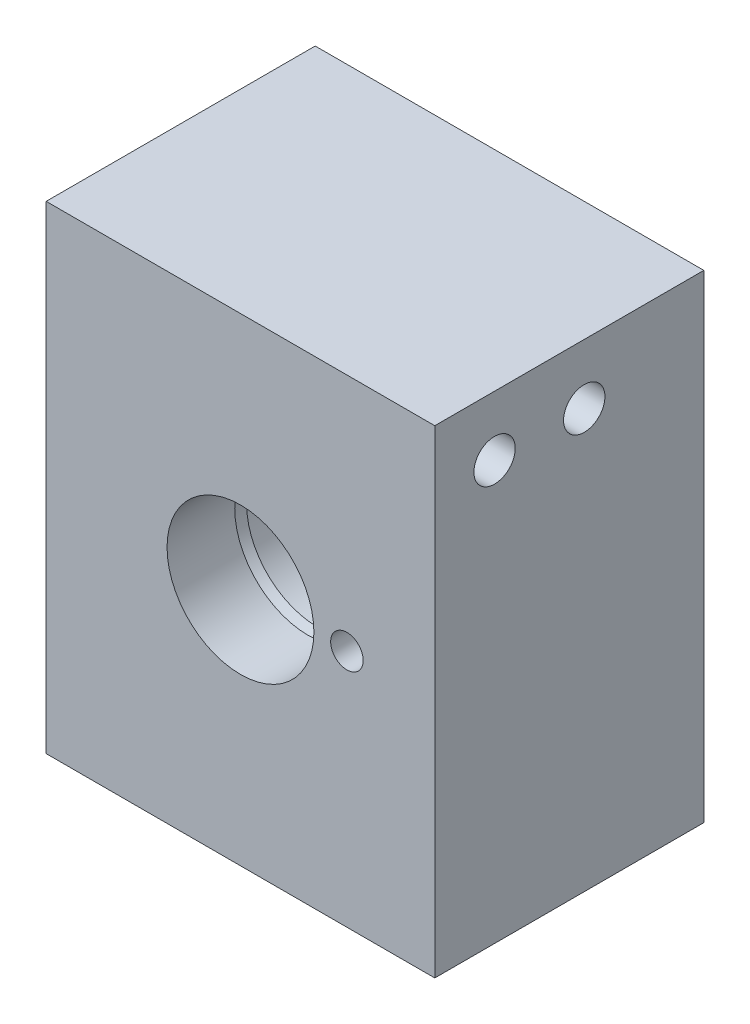
ISO-10303-21;
HEADER;
FILE_DESCRIPTION(('STEP AP214'),'2;1');
FILE_NAME('part.step','',(''),(''),'','','');
FILE_SCHEMA(('AUTOMOTIVE_DESIGN { 1 0 10303 214 1 1 1 1 }'));
ENDSEC;
DATA;
#1=APPLICATION_CONTEXT('core data for automotive mechanical design processes');
#2=APPLICATION_PROTOCOL_DEFINITION('international standard','automotive_design',2000,#1);
#3=PRODUCT_CONTEXT('',#1,'mechanical');
#4=PRODUCT('Part','Part','',(#3));
#5=PRODUCT_RELATED_PRODUCT_CATEGORY('part','',(#4));
#6=PRODUCT_DEFINITION_FORMATION('','',#4);
#7=PRODUCT_DEFINITION_CONTEXT('part definition',#1,'design');
#8=PRODUCT_DEFINITION('design','',#6,#7);
#9=PRODUCT_DEFINITION_SHAPE('','',#8);
#10=(LENGTH_UNIT() NAMED_UNIT(*) SI_UNIT(.MILLI.,.METRE.));
#11=(NAMED_UNIT(*) PLANE_ANGLE_UNIT() SI_UNIT($,.RADIAN.));
#12=(NAMED_UNIT(*) SI_UNIT($,.STERADIAN.) SOLID_ANGLE_UNIT());
#13=UNCERTAINTY_MEASURE_WITH_UNIT(LENGTH_MEASURE(1.E-05),#10,'distance_accuracy_value','');
#14=(GEOMETRIC_REPRESENTATION_CONTEXT(3) GLOBAL_UNCERTAINTY_ASSIGNED_CONTEXT((#13)) GLOBAL_UNIT_ASSIGNED_CONTEXT((#10,
#11,#12)) REPRESENTATION_CONTEXT('',''));
#15=CARTESIAN_POINT('',(0.,0.,0.));
#16=DIRECTION('',(0.,0.,1.));
#17=DIRECTION('',(1.,0.,0.));
#18=AXIS2_PLACEMENT_3D('',#15,#16,#17);
#19=CARTESIAN_POINT('',(19.0499999999998,50.8,22.225));
#20=DIRECTION('',(0.,0.,-1.));
#21=DIRECTION('',(-1.,0.,0.));
#22=AXIS2_PLACEMENT_3D('',#19,#20,#21);
#23=PLANE('',#22);
#24=CARTESIAN_POINT('',(9.71549999999977,25.4,22.225));
#25=DIRECTION('',(0.,0.,1.));
#26=DIRECTION('',(1.,0.,0.));
#27=AXIS2_PLACEMENT_3D('',#24,#25,#26);
#28=CIRCLE('',#27,1.72719999999999);
#29=CARTESIAN_POINT('',(11.4426999999998,25.4,22.225));
#30=VERTEX_POINT('',#29);
#31=EDGE_CURVE('E316',#30,#30,#28,.T.);
#32=ORIENTED_EDGE('',*,*,#31,.F.);
#33=EDGE_LOOP('',(#32));
#34=FACE_BOUND('',#33,.T.);
#35=CARTESIAN_POINT('',(-1.58750000000023,25.4,22.225));
#36=DIRECTION('',(0.,0.,-1.));
#37=DIRECTION('',(-1.,0.,0.));
#38=AXIS2_PLACEMENT_3D('',#35,#36,#37);
#39=CIRCLE('',#38,7.7978);
#40=CARTESIAN_POINT('',(-9.38530000000023,25.4,22.225));
#41=VERTEX_POINT('',#40);
#42=EDGE_CURVE('E231',#41,#41,#39,.T.);
#43=ORIENTED_EDGE('',*,*,#42,.T.);
#44=EDGE_LOOP('',(#43));
#45=FACE_BOUND('',#44,.T.);
#46=DIRECTION('',(1.,0.,0.));
#47=VECTOR('',#46,1.);
#48=CARTESIAN_POINT('',(19.0499999999998,0.,22.225));
#49=LINE('',#48,#47);
#50=CARTESIAN_POINT('',(-22.2250000000002,0.,22.225));
#51=VERTEX_POINT('',#50);
#52=CARTESIAN_POINT('',(19.0499999999998,0.,22.225));
#53=VERTEX_POINT('',#52);
#54=EDGE_CURVE('E253',#51,#53,#49,.T.);
#55=ORIENTED_EDGE('',*,*,#54,.T.);
#56=DIRECTION('',(0.,-1.,0.));
#57=VECTOR('',#56,1.);
#58=CARTESIAN_POINT('',(19.0499999999998,50.8,22.225));
#59=LINE('',#58,#57);
#60=CARTESIAN_POINT('',(19.0499999999998,50.8,22.225));
#61=VERTEX_POINT('',#60);
#62=EDGE_CURVE('E223',#61,#53,#59,.T.);
#63=ORIENTED_EDGE('',*,*,#62,.F.);
#64=DIRECTION('',(1.,0.,0.));
#65=VECTOR('',#64,1.);
#66=CARTESIAN_POINT('',(19.0499999999998,50.8,22.225));
#67=LINE('',#66,#65);
#68=CARTESIAN_POINT('',(-22.2250000000002,50.8,22.225));
#69=VERTEX_POINT('',#68);
#70=EDGE_CURVE('E246',#69,#61,#67,.T.);
#71=ORIENTED_EDGE('',*,*,#70,.F.);
#72=DIRECTION('',(0.,-1.,0.));
#73=VECTOR('',#72,1.);
#74=CARTESIAN_POINT('',(-22.2250000000002,50.8,22.225));
#75=LINE('',#74,#73);
#76=EDGE_CURVE('E241',#69,#51,#75,.T.);
#77=ORIENTED_EDGE('',*,*,#76,.T.);
#78=EDGE_LOOP('',(#55,#63,#71,#77));
#79=FACE_BOUND('',#78,.T.);
#80=ADVANCED_FACE('F45',(#34,#45,#79),#23,.F.);
#81=CARTESIAN_POINT('',(19.0499999999998,50.8,-6.35));
#82=DIRECTION('',(-1.,0.,0.));
#83=DIRECTION('',(0.,0.,1.));
#84=AXIS2_PLACEMENT_3D('',#81,#82,#83);
#85=PLANE('',#84);
#86=CARTESIAN_POINT('',(19.0499999999998,44.45,6.35000000000001));
#87=DIRECTION('',(-1.,0.,0.));
#88=DIRECTION('',(0.,0.,1.));
#89=AXIS2_PLACEMENT_3D('',#86,#87,#88);
#90=CIRCLE('',#89,2.19709999999999);
#91=CARTESIAN_POINT('',(19.0499999999998,44.45,8.54709999999999));
#92=VERTEX_POINT('',#91);
#93=EDGE_CURVE('E344',#92,#92,#90,.T.);
#94=ORIENTED_EDGE('',*,*,#93,.T.);
#95=EDGE_LOOP('',(#94));
#96=FACE_BOUND('',#95,.T.);
#97=CARTESIAN_POINT('',(19.0499999999998,44.45,15.875));
#98=DIRECTION('',(-1.,0.,0.));
#99=DIRECTION('',(0.,0.,1.));
#100=AXIS2_PLACEMENT_3D('',#97,#98,#99);
#101=CIRCLE('',#100,2.19709999999999);
#102=CARTESIAN_POINT('',(19.0499999999998,44.45,18.0721));
#103=VERTEX_POINT('',#102);
#104=EDGE_CURVE('E336',#103,#103,#101,.T.);
#105=ORIENTED_EDGE('',*,*,#104,.T.);
#106=EDGE_LOOP('',(#105));
#107=FACE_BOUND('',#106,.T.);
#108=DIRECTION('',(0.,0.,-1.));
#109=VECTOR('',#108,1.);
#110=CARTESIAN_POINT('',(19.0499999999998,0.,-6.35));
#111=LINE('',#110,#109);
#112=CARTESIAN_POINT('',(19.0499999999998,0.,-6.35));
#113=VERTEX_POINT('',#112);
#114=EDGE_CURVE('E250',#53,#113,#111,.T.);
#115=ORIENTED_EDGE('',*,*,#114,.T.);
#116=DIRECTION('',(0.,-1.,0.));
#117=VECTOR('',#116,1.);
#118=CARTESIAN_POINT('',(19.0499999999998,50.8,-6.35));
#119=LINE('',#118,#117);
#120=CARTESIAN_POINT('',(19.0499999999998,50.8,-6.35));
#121=VERTEX_POINT('',#120);
#122=EDGE_CURVE('E234',#121,#113,#119,.T.);
#123=ORIENTED_EDGE('',*,*,#122,.F.);
#124=DIRECTION('',(0.,0.,-1.));
#125=VECTOR('',#124,1.);
#126=CARTESIAN_POINT('',(19.0499999999998,50.8,-6.35));
#127=LINE('',#126,#125);
#128=EDGE_CURVE('E105',#61,#121,#127,.T.);
#129=ORIENTED_EDGE('',*,*,#128,.F.);
#130=ORIENTED_EDGE('',*,*,#62,.T.);
#131=EDGE_LOOP('',(#115,#123,#129,#130));
#132=FACE_BOUND('',#131,.T.);
#133=ADVANCED_FACE('F137',(#96,#107,#132),#85,.F.);
#134=CARTESIAN_POINT('',(-22.2250000000002,50.8,-6.35));
#135=DIRECTION('',(0.,0.,1.));
#136=DIRECTION('',(1.,0.,0.));
#137=AXIS2_PLACEMENT_3D('',#134,#135,#136);
#138=PLANE('',#137);
#139=CARTESIAN_POINT('',(-1.58750000000023,25.4,-6.35));
#140=DIRECTION('',(0.,0.,-1.));
#141=DIRECTION('',(-1.,0.,0.));
#142=AXIS2_PLACEMENT_3D('',#139,#140,#141);
#143=CIRCLE('',#142,9.525);
#144=CARTESIAN_POINT('',(-11.1125000000002,25.4,-6.35));
#145=VERTEX_POINT('',#144);
#146=EDGE_CURVE('E230',#145,#145,#143,.T.);
#147=ORIENTED_EDGE('',*,*,#146,.F.);
#148=EDGE_LOOP('',(#147));
#149=FACE_BOUND('',#148,.T.);
#150=DIRECTION('',(-1.,0.,0.));
#151=VECTOR('',#150,1.);
#152=CARTESIAN_POINT('',(-22.2250000000002,0.,-6.35));
#153=LINE('',#152,#151);
#154=CARTESIAN_POINT('',(-22.2250000000002,0.,-6.35));
#155=VERTEX_POINT('',#154);
#156=EDGE_CURVE('E247',#113,#155,#153,.T.);
#157=ORIENTED_EDGE('',*,*,#156,.T.);
#158=DIRECTION('',(0.,-1.,0.));
#159=VECTOR('',#158,1.);
#160=CARTESIAN_POINT('',(-22.2250000000002,50.8,-6.35));
#161=LINE('',#160,#159);
#162=CARTESIAN_POINT('',(-22.2250000000002,50.8,-6.35));
#163=VERTEX_POINT('',#162);
#164=EDGE_CURVE('E238',#163,#155,#161,.T.);
#165=ORIENTED_EDGE('',*,*,#164,.F.);
#166=DIRECTION('',(-1.,0.,0.));
#167=VECTOR('',#166,1.);
#168=CARTESIAN_POINT('',(-22.2250000000002,50.8,-6.35));
#169=LINE('',#168,#167);
#170=EDGE_CURVE('E260',#121,#163,#169,.T.);
#171=ORIENTED_EDGE('',*,*,#170,.F.);
#172=ORIENTED_EDGE('',*,*,#122,.T.);
#173=EDGE_LOOP('',(#157,#165,#171,#172));
#174=FACE_BOUND('',#173,.T.);
#175=ADVANCED_FACE('F142',(#149,#174),#138,.F.);
#176=CARTESIAN_POINT('',(-22.2250000000002,50.8,-6.35));
#177=DIRECTION('',(1.,0.,0.));
#178=DIRECTION('',(0.,0.,-1.));
#179=AXIS2_PLACEMENT_3D('',#176,#177,#178);
#180=PLANE('',#179);
#181=CARTESIAN_POINT('',(-22.2250000000002,44.45,6.35000000000001));
#182=DIRECTION('',(-1.,0.,0.));
#183=DIRECTION('',(0.,0.,1.));
#184=AXIS2_PLACEMENT_3D('',#181,#182,#183);
#185=CIRCLE('',#184,2.19709999999999);
#186=CARTESIAN_POINT('',(-22.2250000000002,44.45,8.5471));
#187=VERTEX_POINT('',#186);
#188=EDGE_CURVE('E348',#187,#187,#185,.T.);
#189=ORIENTED_EDGE('',*,*,#188,.F.);
#190=EDGE_LOOP('',(#189));
#191=FACE_BOUND('',#190,.T.);
#192=CARTESIAN_POINT('',(-22.2250000000002,44.45,15.875));
#193=DIRECTION('',(-1.,0.,0.));
#194=DIRECTION('',(0.,0.,1.));
#195=AXIS2_PLACEMENT_3D('',#192,#193,#194);
#196=CIRCLE('',#195,2.19709999999999);
#197=CARTESIAN_POINT('',(-22.2250000000002,44.45,18.0721));
#198=VERTEX_POINT('',#197);
#199=EDGE_CURVE('E340',#198,#198,#196,.T.);
#200=ORIENTED_EDGE('',*,*,#199,.F.);
#201=EDGE_LOOP('',(#200));
#202=FACE_BOUND('',#201,.T.);
#203=DIRECTION('',(0.,0.,1.));
#204=VECTOR('',#203,1.);
#205=CARTESIAN_POINT('',(-22.2250000000002,0.,-6.35));
#206=LINE('',#205,#204);
#207=EDGE_CURVE('E97',#155,#51,#206,.T.);
#208=ORIENTED_EDGE('',*,*,#207,.T.);
#209=ORIENTED_EDGE('',*,*,#76,.F.);
#210=DIRECTION('',(0.,0.,1.));
#211=VECTOR('',#210,1.);
#212=CARTESIAN_POINT('',(-22.2250000000002,50.8,-6.35));
#213=LINE('',#212,#211);
#214=EDGE_CURVE('E76',#163,#69,#213,.T.);
#215=ORIENTED_EDGE('',*,*,#214,.F.);
#216=ORIENTED_EDGE('',*,*,#164,.T.);
#217=EDGE_LOOP('',(#208,#209,#215,#216));
#218=FACE_BOUND('',#217,.T.);
#219=ADVANCED_FACE('F150',(#191,#202,#218),#180,.F.);
#220=CARTESIAN_POINT('',(0.,50.8,0.));
#221=DIRECTION('',(0.,1.,0.));
#222=DIRECTION('',(0.,0.,1.));
#223=AXIS2_PLACEMENT_3D('',#220,#221,#222);
#224=PLANE('',#223);
#225=ORIENTED_EDGE('',*,*,#70,.T.);
#226=ORIENTED_EDGE('',*,*,#128,.T.);
#227=ORIENTED_EDGE('',*,*,#170,.T.);
#228=ORIENTED_EDGE('',*,*,#214,.T.);
#229=EDGE_LOOP('',(#225,#226,#227,#228));
#230=FACE_BOUND('',#229,.T.);
#231=ADVANCED_FACE('F154',(#230),#224,.T.);
#232=CARTESIAN_POINT('',(0.,0.,0.));
#233=DIRECTION('',(0.,1.,0.));
#234=DIRECTION('',(0.,0.,1.));
#235=AXIS2_PLACEMENT_3D('',#232,#233,#234);
#236=PLANE('',#235);
#237=CARTESIAN_POINT('',(-1.58750000000023,0.,7.93750000000001));
#238=DIRECTION('',(0.,-1.,0.));
#239=DIRECTION('',(0.,0.,-1.));
#240=AXIS2_PLACEMENT_3D('',#237,#238,#239);
#241=CIRCLE('',#240,4.7427388);
#242=CARTESIAN_POINT('',(-1.58750000000023,0.,3.19476120000001));
#243=VERTEX_POINT('',#242);
#244=EDGE_CURVE('E332',#243,#243,#241,.T.);
#245=ORIENTED_EDGE('',*,*,#244,.F.);
#246=EDGE_LOOP('',(#245));
#247=FACE_BOUND('',#246,.T.);
#248=ORIENTED_EDGE('',*,*,#54,.F.);
#249=ORIENTED_EDGE('',*,*,#207,.F.);
#250=ORIENTED_EDGE('',*,*,#156,.F.);
#251=ORIENTED_EDGE('',*,*,#114,.F.);
#252=EDGE_LOOP('',(#248,#249,#250,#251));
#253=FACE_BOUND('',#252,.T.);
#254=ADVANCED_FACE('F156',(#247,#253),#236,.F.);
#255=CARTESIAN_POINT('',(-1.58750000000023,25.4,0.));
#256=DIRECTION('',(0.,0.,-1.));
#257=DIRECTION('',(-1.,0.,0.));
#258=AXIS2_PLACEMENT_3D('',#255,#256,#257);
#259=CYLINDRICAL_SURFACE('',#258,9.525);
#260=CARTESIAN_POINT('',(-1.58750000000023,25.4,0.));
#261=DIRECTION('',(0.,0.,-1.));
#262=DIRECTION('',(-1.,0.,0.));
#263=AXIS2_PLACEMENT_3D('',#260,#261,#262);
#264=CIRCLE('',#263,9.525);
#265=CARTESIAN_POINT('',(-11.1125000000002,25.4,0.));
#266=VERTEX_POINT('',#265);
#267=EDGE_CURVE('E257',#266,#266,#264,.T.);
#268=ORIENTED_EDGE('',*,*,#267,.F.);
#269=EDGE_LOOP('',(#268));
#270=FACE_BOUND('',#269,.T.);
#271=ORIENTED_EDGE('',*,*,#146,.T.);
#272=EDGE_LOOP('',(#271));
#273=FACE_BOUND('',#272,.T.);
#274=ADVANCED_FACE('F159',(#270,#273),#259,.F.);
#275=CARTESIAN_POINT('',(-1.58750000000023,25.4,0.));
#276=DIRECTION('',(0.,0.,-1.));
#277=DIRECTION('',(-1.,0.,0.));
#278=AXIS2_PLACEMENT_3D('',#275,#276,#277);
#279=PLANE('',#278);
#280=CARTESIAN_POINT('',(-1.58750000000023,25.4,0.));
#281=DIRECTION('',(0.,0.,-1.));
#282=DIRECTION('',(-1.,0.,0.));
#283=AXIS2_PLACEMENT_3D('',#280,#281,#282);
#284=CIRCLE('',#283,2.44543946446517);
#285=CARTESIAN_POINT('',(-4.0329394644654,25.4,0.));
#286=VERTEX_POINT('',#285);
#287=EDGE_CURVE('E226',#286,#286,#284,.F.);
#288=ORIENTED_EDGE('',*,*,#287,.T.);
#289=EDGE_LOOP('',(#288));
#290=FACE_BOUND('',#289,.T.);
#291=ORIENTED_EDGE('',*,*,#267,.T.);
#292=EDGE_LOOP('',(#291));
#293=FACE_BOUND('',#292,.T.);
#294=ADVANCED_FACE('F165',(#290,#293),#279,.T.);
#295=CARTESIAN_POINT('',(-1.58750000000023,25.4,-0.714966432733395));
#296=DIRECTION('',(0.,0.,-1.));
#297=DIRECTION('',(-1.,0.,0.));
#298=AXIS2_PLACEMENT_3D('',#295,#296,#297);
#299=CYLINDRICAL_SURFACE('',#298,7.7978);
#300=CARTESIAN_POINT('',(-1.58750000000023,25.4,15.0368));
#301=DIRECTION('',(0.,0.,-1.));
#302=DIRECTION('',(-1.,0.,0.));
#303=AXIS2_PLACEMENT_3D('',#300,#301,#302);
#304=CIRCLE('',#303,7.79780000000001);
#305=CARTESIAN_POINT('',(-9.38530000000024,25.4,15.0368));
#306=VERTEX_POINT('',#305);
#307=EDGE_CURVE('E276',#306,#306,#304,.T.);
#308=ORIENTED_EDGE('',*,*,#307,.T.);
#309=EDGE_LOOP('',(#308));
#310=FACE_BOUND('',#309,.T.);
#311=ORIENTED_EDGE('',*,*,#42,.F.);
#312=EDGE_LOOP('',(#311));
#313=FACE_BOUND('',#312,.T.);
#314=ADVANCED_FACE('F169',(#310,#313),#299,.F.);
#315=CARTESIAN_POINT('',(-1.58750000000023,25.4,15.0368));
#316=DIRECTION('',(0.,0.,1.));
#317=DIRECTION('',(1.,0.,0.));
#318=AXIS2_PLACEMENT_3D('',#315,#316,#317);
#319=CONICAL_SURFACE('',#318,7.79780000000001,0.26179938779915);
#320=CARTESIAN_POINT('',(-1.58750000000023,25.4,14.0414620496214));
#321=DIRECTION('',(0.,0.,-1.));
#322=DIRECTION('',(-1.,0.,0.));
#323=AXIS2_PLACEMENT_3D('',#320,#321,#322);
#324=CIRCLE('',#323,7.5311);
#325=CARTESIAN_POINT('',(-9.11860000000023,25.4,14.0414620496214));
#326=VERTEX_POINT('',#325);
#327=EDGE_CURVE('E280',#326,#326,#324,.T.);
#328=ORIENTED_EDGE('',*,*,#327,.T.);
#329=EDGE_LOOP('',(#328));
#330=FACE_BOUND('',#329,.T.);
#331=ORIENTED_EDGE('',*,*,#307,.F.);
#332=EDGE_LOOP('',(#331));
#333=FACE_BOUND('',#332,.T.);
#334=ADVANCED_FACE('F173',(#330,#333),#319,.F.);
#335=CARTESIAN_POINT('',(-1.58750000000023,25.4,-0.714966432733395));
#336=DIRECTION('',(0.,0.,-1.));
#337=DIRECTION('',(-1.,0.,0.));
#338=AXIS2_PLACEMENT_3D('',#335,#336,#337);
#339=CYLINDRICAL_SURFACE('',#338,7.5311);
#340=CARTESIAN_POINT('',(-2.55736766107569,17.9316116912683,8.2804));
#341=CARTESIAN_POINT('',(-2.5477067663915,17.9303578406815,8.30772459231957));
#342=CARTESIAN_POINT('',(-2.53689746578998,17.9289724033282,8.33462185575252));
#343=CARTESIAN_POINT('',(-2.51305674615965,17.9259810746937,8.38739730751946));
#344=CARTESIAN_POINT('',(-2.50002552350797,17.9243752028972,8.41327558566445));
#345=CARTESIAN_POINT('',(-2.45775503600033,17.9192962684268,8.48905839503691));
#346=CARTESIAN_POINT('',(-2.42530631907,17.9155574323269,8.53720284854724));
#347=CARTESIAN_POINT('',(-2.35280950394204,17.9077978000471,8.62733754288451));
#348=CARTESIAN_POINT('',(-2.3127591572553,17.9037769206639,8.66932595628407));
#349=CARTESIAN_POINT('',(-2.22617186977165,17.8959043820133,8.74599443706135));
#350=CARTESIAN_POINT('',(-2.17963583329771,17.8920526992523,8.78067552163566));
#351=CARTESIAN_POINT('',(-2.08125684328244,17.8849414120671,8.84181750391356));
#352=CARTESIAN_POINT('',(-2.02940213849025,17.8816831648514,8.86825965457327));
#353=CARTESIAN_POINT('',(-1.92192819540319,17.8761368052371,8.91205028677667));
#354=CARTESIAN_POINT('',(-1.8663086310293,17.8738487769952,8.92939797949755));
#355=CARTESIAN_POINT('',(-1.75327103719716,17.8705138100463,8.95439365163883));
#356=CARTESIAN_POINT('',(-1.69586689860712,17.8694589726472,8.96210338531352));
#357=CARTESIAN_POINT('',(-1.5805736517984,17.8686826209368,8.96779431890696));
#358=CARTESIAN_POINT('',(-1.52268459041117,17.8689609793208,8.96577644769887));
#359=CARTESIAN_POINT('',(-1.40845656600399,17.8708131982632,8.95212045605599));
#360=CARTESIAN_POINT('',(-1.35210999713944,17.8723786652761,8.94054466305995));
#361=CARTESIAN_POINT('',(-1.24216819663837,17.8766203373028,8.90819720045155));
#362=CARTESIAN_POINT('',(-1.18857293181403,17.8792965289148,8.8874256417929));
#363=CARTESIAN_POINT('',(-1.08545173542523,17.8854744293318,8.83720628039021));
#364=CARTESIAN_POINT('',(-1.03593962803934,17.8889787987898,8.80773043594884));
#365=CARTESIAN_POINT('',(-0.942522653047282,17.8964227606842,8.74094583118658));
#366=CARTESIAN_POINT('',(-0.898619914115468,17.9003625172923,8.70363411138021));
#367=CARTESIAN_POINT('',(-0.817293322330779,17.9082754749346,8.62186954970613));
#368=CARTESIAN_POINT('',(-0.779929543030063,17.9122486668622,8.57735706000777));
#369=CARTESIAN_POINT('',(-0.713240809393059,17.9197415157713,8.48269307552192));
#370=CARTESIAN_POINT('',(-0.683903233709746,17.9232618801588,8.4325506111728));
#371=CARTESIAN_POINT('',(-0.651231220003841,17.9273212093951,8.36405863146191));
#372=CARTESIAN_POINT('',(-0.643891156257988,17.9282453232318,8.34756441970571));
#373=CARTESIAN_POINT('',(-0.630098332015932,17.9300001654274,8.3142352996307));
#374=CARTESIAN_POINT('',(-0.623644165930705,17.9308310413287,8.2974009807905));
#375=CARTESIAN_POINT('',(-0.617632338924758,17.9316116912683,8.2804));
#376=B_SPLINE_CURVE_WITH_KNOTS('',3,(#340,#341,#342,#343,#344,#345,#346,#347,#348,#349,#350,
#351,#352,#353,#354,#355,#356,#357,#358,#359,#360,#361,#362,#363,#364,#365,#366,#367,#368,#369,
#370,#371,#372,#373,#374,#375),.UNSPECIFIED.,.F.,.F.,(4,2,2,2,2,2,2,2,2,2,2,2,2,2,2,2,2,4),(0.,
0.0869734045895187,0.173939126307011,0.347581313453382,0.521274942561418,0.694944377128772,
0.869006144659622,1.04308300722821,1.21603867570771,1.38897782925875,1.56079806726884,
1.73261623219726,1.90499407962141,2.07743714887888,2.25138961835494,2.42506695130936,
2.47928127793309,2.53340856699384),.UNSPECIFIED.);
#377=CARTESIAN_POINT('',(-2.5573676610757,17.9316116912683,8.2804));
#378=VERTEX_POINT('',#377);
#379=CARTESIAN_POINT('',(-0.61763233892476,17.9316116912683,8.2804));
#380=VERTEX_POINT('',#379);
#381=EDGE_CURVE('E186',#378,#380,#376,.T.);
#382=ORIENTED_EDGE('',*,*,#381,.F.);
#383=CARTESIAN_POINT('',(-1.58750000000023,25.4,8.2804));
#384=DIRECTION('',(0.,0.,-1.));
#385=DIRECTION('',(-1.,0.,0.));
#386=AXIS2_PLACEMENT_3D('',#383,#384,#385);
#387=CIRCLE('',#386,7.5311);
#388=EDGE_CURVE('E284',#378,#380,#387,.T.);
#389=ORIENTED_EDGE('',*,*,#388,.T.);
#390=EDGE_LOOP('',(#382,#389));
#391=FACE_BOUND('',#390,.T.);
#392=ORIENTED_EDGE('',*,*,#327,.F.);
#393=EDGE_LOOP('',(#392));
#394=FACE_BOUND('',#393,.T.);
#395=ADVANCED_FACE('F177',(#391,#394),#339,.F.);
#396=CARTESIAN_POINT('',(-1.58750000000023,25.4,8.2804));
#397=DIRECTION('',(0.,0.,-1.));
#398=DIRECTION('',(-1.,0.,0.));
#399=AXIS2_PLACEMENT_3D('',#396,#397,#398);
#400=TOROIDAL_SURFACE('',#399,7.3279,0.203200000000001);
#401=CARTESIAN_POINT('',(-0.617703072803619,17.9316026051435,8.28060000000002));
#402=CARTESIAN_POINT('',(-0.613546262296513,17.932120297984,8.26887586265333));
#403=CARTESIAN_POINT('',(-0.609630946151759,17.9336539911522,8.25710774749264));
#404=CARTESIAN_POINT('',(-0.602332443533644,17.9387154016661,8.23383220345072));
#405=CARTESIAN_POINT('',(-0.598949524472328,17.9422441170098,8.22232490804189));
#406=CARTESIAN_POINT('',(-0.592764928059143,17.9512632604429,8.19991653880816));
#407=CARTESIAN_POINT('',(-0.589964064857744,17.9567564074655,8.18901632952776));
#408=CARTESIAN_POINT('',(-0.584949001776714,17.9695790498184,8.16821496397306));
#409=CARTESIAN_POINT('',(-0.582734391417135,17.9769072532538,8.15831311169709));
#410=CARTESIAN_POINT('',(-0.578903358011034,17.9930039059018,8.14008652233974));
#411=CARTESIAN_POINT('',(-0.57727307952042,18.0017307076125,8.13172791536335));
#412=CARTESIAN_POINT('',(-0.574476174097145,18.0205159037195,8.11656979074599));
#413=CARTESIAN_POINT('',(-0.573309621338435,18.0305745107981,8.10977052259822));
#414=CARTESIAN_POINT('',(-0.571396458547195,18.0515069427796,8.09809787035813));
#415=CARTESIAN_POINT('',(-0.570641451920532,18.062358903614,8.09318663336859));
#416=CARTESIAN_POINT('',(-0.569458935731629,18.0847500090808,8.08525747660114));
#417=CARTESIAN_POINT('',(-0.569031377859307,18.0962890520738,8.08223927754618));
#418=CARTESIAN_POINT('',(-0.568470075371454,18.1195580829496,8.07823301786864));
#419=CARTESIAN_POINT('',(-0.568332377469826,18.1312832742063,8.07721765358666));
#420=CARTESIAN_POINT('',(-0.568327576625892,18.1547379469732,8.07718280708525));
#421=CARTESIAN_POINT('',(-0.568460468255977,18.1664674283926,8.07816328483231));
#422=CARTESIAN_POINT('',(-0.569008998116953,18.1894064247518,8.08208062381833));
#423=CARTESIAN_POINT('',(-0.569420336838563,18.2006211165932,8.0849877219432));
#424=CARTESIAN_POINT('',(-0.570561816516114,18.2223783285891,8.09266244571031));
#425=CARTESIAN_POINT('',(-0.571291913585882,18.2329209410456,8.09742981522356));
#426=CARTESIAN_POINT('',(-0.573107038950915,18.2527584845884,8.10855987125042));
#427=CARTESIAN_POINT('',(-0.574183068202366,18.2620774016053,8.11488124272173));
#428=CARTESIAN_POINT('',(-0.576754294066064,18.2794634355686,8.12898892273869));
#429=CARTESIAN_POINT('',(-0.578249369962137,18.2875309119836,8.13677480918446));
#430=CARTESIAN_POINT('',(-0.581656063042185,18.3019317261704,8.15330196169566));
#431=CARTESIAN_POINT('',(-0.583553338577852,18.3083110502506,8.16200615106384));
#432=CARTESIAN_POINT('',(-0.587815168497594,18.3194771785174,8.18027920139873));
#433=CARTESIAN_POINT('',(-0.590179749578377,18.3242638916777,8.18984811174915));
#434=CARTESIAN_POINT('',(-0.595342896633624,18.3320990829537,8.20943676093989));
#435=CARTESIAN_POINT('',(-0.598136662670793,18.3351652251908,8.21945073481764));
#436=CARTESIAN_POINT('',(-0.604137773848134,18.3396107642605,8.23971414967213));
#437=CARTESIAN_POINT('',(-0.607344784056007,18.3409915177034,8.24996339449381));
#438=CARTESIAN_POINT('',(-0.612977354148499,18.3419351289361,8.26701842008005));
#439=CARTESIAN_POINT('',(-0.615307091711731,18.3419505159037,8.27383328893562));
#440=CARTESIAN_POINT('',(-0.617703072803613,18.3416116986595,8.2806));
#441=B_SPLINE_CURVE_WITH_KNOTS('',3,(#401,#402,#403,#404,#405,#406,#407,#408,#409,#410,#411,
#412,#413,#414,#415,#416,#417,#418,#419,#420,#421,#422,#423,#424,#425,#426,#427,#428,#429,#430,
#431,#432,#433,#434,#435,#436,#437,#438,#439,#440),.UNSPECIFIED.,.F.,.F.,(4,2,2,2,2,2,2,2,2,2,2,
2,2,2,2,2,2,2,2,4),(0.,0.0373131750428451,0.0746450323153936,0.112028761172008,
0.149386245202863,0.185787900373928,0.222195375729221,0.25782923325618,0.293457832536231,
0.328597272588573,0.363736007804841,0.39834418059306,0.432947590081601,0.466715181289288,
0.500473054933769,0.533184958190178,0.565898730786207,0.598270199399153,0.630615594214822,
0.652179875229383),.UNSPECIFIED.);
#442=CARTESIAN_POINT('',(-0.568329945495095,18.1433195736618,8.0772));
#443=VERTEX_POINT('',#442);
#444=EDGE_CURVE('E60',#380,#443,#441,.T.);
#445=ORIENTED_EDGE('',*,*,#444,.F.);
#446=ORIENTED_EDGE('',*,*,#388,.F.);
#447=CARTESIAN_POINT('',(-2.55729692719684,18.3416116986595,8.2806));
#448=CARTESIAN_POINT('',(-2.56108146661404,18.3421536793887,8.26992502711044));
#449=CARTESIAN_POINT('',(-2.56469406969128,18.3418033358918,8.25913131555557));
#450=CARTESIAN_POINT('',(-2.57151147349962,18.3392780046336,8.23761426510672));
#451=CARTESIAN_POINT('',(-2.57471570655659,18.337100508143,8.22689104340975));
#452=CARTESIAN_POINT('',(-2.58064944541499,18.3308709887759,8.20582629662383));
#453=CARTESIAN_POINT('',(-2.58337768046316,18.3268140507396,8.19548584961941));
#454=CARTESIAN_POINT('',(-2.58832110161222,18.3169014547988,8.17558746732836));
#455=CARTESIAN_POINT('',(-2.59053690275349,18.3110479730201,8.16602860296615));
#456=CARTESIAN_POINT('',(-2.59438509386832,18.2979977931096,8.14841247816701));
#457=CARTESIAN_POINT('',(-2.59603882784074,18.2908713553042,8.14030771489203));
#458=CARTESIAN_POINT('',(-2.59893092312348,18.2753273622204,8.12535449894555));
#459=CARTESIAN_POINT('',(-2.60016911535691,18.2669092834202,8.11850655816608));
#460=CARTESIAN_POINT('',(-2.60227642472823,18.2490729032813,8.10629244330972));
#461=CARTESIAN_POINT('',(-2.60314707499409,18.2396589658683,8.10092014733504));
#462=CARTESIAN_POINT('',(-2.60457942871109,18.2200716749696,8.09175534944304));
#463=CARTESIAN_POINT('',(-2.60514114165586,18.209898344831,8.08796279898115));
#464=CARTESIAN_POINT('',(-2.60601106077012,18.1887764834947,8.08195919179725));
#465=CARTESIAN_POINT('',(-2.606311735918,18.1778142280109,8.07979534272493));
#466=CARTESIAN_POINT('',(-2.60666155142338,18.1556799501467,8.07726784202493));
#467=CARTESIAN_POINT('',(-2.60671064774969,18.1445078913901,8.07690450552229));
#468=CARTESIAN_POINT('',(-2.60656204706686,18.1219449880811,8.07798687139186));
#469=CARTESIAN_POINT('',(-2.6063575265524,18.1105565750901,8.07948259387697));
#470=CARTESIAN_POINT('',(-2.60567307552504,18.0881847987666,8.08430986850771));
#471=CARTESIAN_POINT('',(-2.60519312634358,18.0772014629439,8.08764154509369));
#472=CARTESIAN_POINT('',(-2.6039086089063,18.0557445713089,8.09610575139991));
#473=CARTESIAN_POINT('',(-2.60309840647963,18.0452835930359,8.10126932455885));
#474=CARTESIAN_POINT('',(-2.60109974161738,18.0253712356354,8.11321504325507));
#475=CARTESIAN_POINT('',(-2.59991126195975,18.0159199025008,8.11999726248187));
#476=CARTESIAN_POINT('',(-2.59708078657774,17.9981598874114,8.13505920865055));
#477=CARTESIAN_POINT('',(-2.59543310156985,17.9898676388934,8.1433572395772));
#478=CARTESIAN_POINT('',(-2.59164111790097,17.9747829252823,8.1611216252477));
#479=CARTESIAN_POINT('',(-2.58949674644627,17.9679906803131,8.17058815114958));
#480=CARTESIAN_POINT('',(-2.58464427762985,17.9559653871667,8.19054963905315));
#481=CARTESIAN_POINT('',(-2.58192759547973,17.9507594352585,8.20105879951069));
#482=CARTESIAN_POINT('',(-2.57595341069205,17.9421616928129,8.2226466550929));
#483=CARTESIAN_POINT('',(-2.57269618510672,17.9387689766531,8.23372505645874));
#484=CARTESIAN_POINT('',(-2.56733888642229,17.9350032979414,8.25083386801228));
#485=CARTESIAN_POINT('',(-2.56541745796542,17.9339607752788,8.25678120076765));
#486=CARTESIAN_POINT('',(-2.56144945700775,17.9323948122447,8.26868809592526));
#487=CARTESIAN_POINT('',(-2.55940316149378,17.9318702643484,8.27464760481245));
#488=CARTESIAN_POINT('',(-2.55729692719684,17.9316026051435,8.28060000000002));
#489=B_SPLINE_CURVE_WITH_KNOTS('',3,(#447,#448,#449,#450,#451,#452,#453,#454,#455,#456,#457,
#458,#459,#460,#461,#462,#463,#464,#465,#466,#467,#468,#469,#470,#471,#472,#473,#474,#475,#476,
#477,#478,#479,#480,#481,#482,#483,#484,#485,#486,#487,#488),.UNSPECIFIED.,.F.,.F.,(4,2,2,2,2,2,
2,2,2,2,2,2,2,2,2,2,2,2,2,2,4),(0.,0.0339996690224755,0.0680460970173767,0.102182071080993,
0.136276858867321,0.168874660767522,0.201485710125608,0.23395935169878,0.26643199530377,
0.299813012412957,0.333199871648843,0.367504810564728,0.401812074943848,0.436730903171164,
0.471651321395938,0.507025244640793,0.542404355526154,0.578357696019818,0.614292665443787,
0.633282027814073,0.652230698959519),.UNSPECIFIED.);
#490=CARTESIAN_POINT('',(-2.60667005450536,18.1433195736618,8.0772));
#491=VERTEX_POINT('',#490);
#492=EDGE_CURVE('E200',#491,#378,#489,.T.);
#493=ORIENTED_EDGE('',*,*,#492,.F.);
#494=CARTESIAN_POINT('',(-1.58750000000023,25.4,8.0772));
#495=DIRECTION('',(0.,0.,-1.));
#496=DIRECTION('',(-1.,0.,0.));
#497=AXIS2_PLACEMENT_3D('',#494,#495,#496);
#498=CIRCLE('',#497,7.3279);
#499=EDGE_CURVE('E288',#491,#443,#498,.T.);
#500=ORIENTED_EDGE('',*,*,#499,.T.);
#501=EDGE_LOOP('',(#445,#446,#493,#500));
#502=FACE_BOUND('',#501,.T.);
#503=ADVANCED_FACE('F182',(#502),#400,.F.);
#504=CARTESIAN_POINT('',(-1.58750000000023,32.7279,8.0772));
#505=DIRECTION('',(0.,0.,1.));
#506=DIRECTION('',(1.,0.,0.));
#507=AXIS2_PLACEMENT_3D('',#504,#505,#506);
#508=PLANE('',#507);
#509=DIRECTION('',(0.,-1.,0.));
#510=VECTOR('',#509,1.);
#511=CARTESIAN_POINT('',(-2.60667005450536,0.,8.0772));
#512=LINE('',#511,#510);
#513=CARTESIAN_POINT('',(-2.60667005450536,19.0668946812063,8.0772));
#514=VERTEX_POINT('',#513);
#515=EDGE_CURVE('E67',#514,#491,#512,.T.);
#516=ORIENTED_EDGE('',*,*,#515,.F.);
#517=CARTESIAN_POINT('',(-6.8107274552444,16.5454459894693,8.0772));
#518=CARTESIAN_POINT('',(-6.62930147074591,16.6544188015162,8.0772));
#519=CARTESIAN_POINT('',(-6.4478737150063,16.7633886646422,8.0772));
#520=CARTESIAN_POINT('',(-6.08501306160895,16.9813200347395,8.0772));
#521=CARTESIAN_POINT('',(-5.90358016394869,17.0902815417067,8.0772));
#522=CARTESIAN_POINT('',(-5.3592657008613,17.4171532386501,8.0772));
#523=CARTESIAN_POINT('',(-4.99637429480906,17.6350470429246,8.0772));
#524=CARTESIAN_POINT('',(-4.45169124265178,17.9619815380968,8.0772));
#525=CARTESIAN_POINT('',(-4.26992469311957,18.0710640315453,8.0772));
#526=CARTESIAN_POINT('',(-3.90635925159379,18.289175678868,8.0772));
#527=CARTESIAN_POINT('',(-3.72456035955454,18.398204832666,8.0772));
#528=CARTESIAN_POINT('',(-3.36090434439859,18.6161610886075,8.0772));
#529=CARTESIAN_POINT('',(-3.17904722201572,18.7250881919738,8.0772));
#530=CARTESIAN_POINT('',(-2.90613514343841,18.8882669789711,8.0772));
#531=CARTESIAN_POINT('',(-2.81514349161661,18.942624532953,8.0772));
#532=CARTESIAN_POINT('',(-2.63308065712839,19.0512062498343,8.0772));
#533=CARTESIAN_POINT('',(-2.54200947456095,19.1054304128995,8.0772));
#534=CARTESIAN_POINT('',(-2.41552860720341,19.1804497108609,8.0772));
#535=CARTESIAN_POINT('',(-2.38019627046045,19.2013751764573,8.0772));
#536=CARTESIAN_POINT('',(-2.30948943836843,19.2431556735195,8.0772));
#537=CARTESIAN_POINT('',(-2.27411494255286,19.2640107041959,8.0772));
#538=CARTESIAN_POINT('',(-2.2033086467449,19.305609670935,8.0772));
#539=CARTESIAN_POINT('',(-2.16787685752121,19.3263536252881,8.0772));
#540=CARTESIAN_POINT('',(-2.09690846083024,19.3676591112614,8.0772));
#541=CARTESIAN_POINT('',(-2.06137185631562,19.3882206479562,8.0772));
#542=CARTESIAN_POINT('',(-1.98831612682949,19.4300523740463,8.0772));
#543=CARTESIAN_POINT('',(-1.95078742499133,19.4513059872894,8.0772));
#544=CARTESIAN_POINT('',(-1.89414341025535,19.4825781925746,8.0772));
#545=CARTESIAN_POINT('',(-1.8751986483206,19.4929034756939,8.0772));
#546=CARTESIAN_POINT('',(-1.83712479087675,19.5132007099955,8.0772));
#547=CARTESIAN_POINT('',(-1.81799572337566,19.5231727138194,8.0772));
#548=CARTESIAN_POINT('',(-1.77760671590959,19.5434260844898,8.0772));
#549=CARTESIAN_POINT('',(-1.75631588559071,19.5536480059236,8.0772));
#550=CARTESIAN_POINT('',(-1.72383440836959,19.5677947201498,8.0772));
#551=CARTESIAN_POINT('',(-1.71290812199012,19.5723154907237,8.0772));
#552=CARTESIAN_POINT('',(-1.69081806362335,19.5807247071127,8.0772));
#553=CARTESIAN_POINT('',(-1.67965439329283,19.5846134176697,8.0772));
#554=CARTESIAN_POINT('',(-1.65356002816468,19.5924672353769,8.0772));
#555=CARTESIAN_POINT('',(-1.6385186400181,19.5960940858325,8.0772));
#556=CARTESIAN_POINT('',(-1.60812093576848,19.6005949103832,8.0772));
#557=CARTESIAN_POINT('',(-1.59276877600271,19.6014938398987,8.0772));
#558=CARTESIAN_POINT('',(-1.56220288622838,19.600194931332,8.0772));
#559=CARTESIAN_POINT('',(-1.54698921866616,19.5979957597793,8.0772));
#560=CARTESIAN_POINT('',(-1.52450392702376,19.5930190664399,8.0772));
#561=CARTESIAN_POINT('',(-1.51702359111327,19.5910646928994,8.0772));
#562=CARTESIAN_POINT('',(-1.50218913410088,19.5867218501536,8.0772));
#563=CARTESIAN_POINT('',(-1.49483500474702,19.584333409449,8.0772));
#564=CARTESIAN_POINT('',(-1.47110276783849,19.5760417292281,8.0772));
#565=CARTESIAN_POINT('',(-1.4549580036673,19.5694828332809,8.0772));
#566=CARTESIAN_POINT('',(-1.4230405162114,19.5555058004655,8.0772));
#567=CARTESIAN_POINT('',(-1.40726824014317,19.5480866882343,8.0772));
#568=CARTESIAN_POINT('',(-1.36021805673496,19.5250862100426,8.0772));
#569=CARTESIAN_POINT('',(-1.3292897255554,19.5087962441812,8.0772));
#570=CARTESIAN_POINT('',(-1.26769043248663,19.4754477679696,8.0772));
#571=CARTESIAN_POINT('',(-1.23702117879335,19.458386218654,8.0772));
#572=CARTESIAN_POINT('',(-1.17594205277733,19.4239294519041,8.0772));
#573=CARTESIAN_POINT('',(-1.1455318125236,19.4065348914476,8.0772));
#574=CARTESIAN_POINT('',(-1.05426203193583,19.3539509424095,8.0772));
#575=CARTESIAN_POINT('',(-0.993568276926023,19.3184759249156,8.0772));
#576=CARTESIAN_POINT('',(-0.872350928944856,19.2472329398636,8.0772));
#577=CARTESIAN_POINT('',(-0.811827341503456,19.2114649629296,8.0772));
#578=CARTESIAN_POINT('',(-0.630281885326394,19.1038823186642,8.0772));
#579=CARTESIAN_POINT('',(-0.50938921024125,19.0318498298676,8.0772));
#580=CARTESIAN_POINT('',(-0.27163035139666,18.8899383400096,8.0772));
#581=CARTESIAN_POINT('',(-0.154760654019156,18.8200652068115,8.0772));
#582=CARTESIAN_POINT('',(0.0788147230745145,18.6802828048429,8.0772));
#583=CARTESIAN_POINT('',(0.195520455861088,18.6103736247738,8.0772));
#584=CARTESIAN_POINT('',(0.312218604863566,18.5404516994371,8.0772));
#585=B_SPLINE_CURVE_WITH_KNOTS('',3,(#517,#518,#519,#520,#521,#522,#523,#524,#525,#526,#527,
#528,#529,#530,#531,#532,#533,#534,#535,#536,#537,#538,#539,#540,#541,#542,#543,#544,#545,#546,
#547,#548,#549,#550,#551,#552,#553,#554,#555,#556,#557,#558,#559,#560,#561,#562,#563,#564,#565,
#566,#567,#568,#569,#570,#571,#572,#573,#574,#575,#576,#577,#578,#579,#580,#581,#582,#583,#584),
.UNSPECIFIED.,.F.,.F.,(4,2,2,2,2,2,2,2,2,2,2,2,2,2,2,2,2,2,2,2,2,2,2,2,2,2,2,2,2,2,2,2,2,4),(0.,
0.634912713994803,1.26982574509633,2.53967255827298,3.17563058037779,3.81158950814368,
4.44754071426661,4.76551557091437,5.08349003241387,5.20668186232618,5.32987506836519,
5.45304732327837,5.5762161409294,5.70559832105083,5.77032279695568,5.83503758744827,
5.90585260999034,5.94131243508342,5.97675736914348,6.02301007965683,6.06883836834231,
6.11468638825966,6.13787272031685,6.1610575305243,6.21327894628413,6.26556016366847,
6.37039156467295,6.47567965869456,6.58077794216303,6.79167864412795,7.00258612232653,
7.42476232730555,7.83325598757735,8.24138305895711),.UNSPECIFIED.);
#586=CARTESIAN_POINT('',(-0.568329945495096,19.0668946812063,8.0772));
#587=VERTEX_POINT('',#586);
#588=EDGE_CURVE('E11',#587,#514,#585,.F.);
#589=ORIENTED_EDGE('',*,*,#588,.F.);
#590=DIRECTION('',(0.,-1.,0.));
#591=VECTOR('',#590,1.);
#592=CARTESIAN_POINT('',(-0.568329945495095,0.,8.0772));
#593=LINE('',#592,#591);
#594=EDGE_CURVE('E355',#443,#587,#593,.F.);
#595=ORIENTED_EDGE('',*,*,#594,.F.);
#596=ORIENTED_EDGE('',*,*,#499,.F.);
#597=EDGE_LOOP('',(#516,#589,#595,#596));
#598=FACE_BOUND('',#597,.T.);
#599=CARTESIAN_POINT('',(-1.58750000000023,25.4,8.0772));
#600=DIRECTION('',(0.,0.,-1.));
#601=DIRECTION('',(-1.,0.,0.));
#602=AXIS2_PLACEMENT_3D('',#599,#600,#601);
#603=CIRCLE('',#602,3.8735);
#604=CARTESIAN_POINT('',(-5.46100000000023,25.4,8.0772));
#605=VERTEX_POINT('',#604);
#606=EDGE_CURVE('E292',#605,#605,#603,.T.);
#607=ORIENTED_EDGE('',*,*,#606,.T.);
#608=EDGE_LOOP('',(#607));
#609=FACE_BOUND('',#608,.T.);
#610=ADVANCED_FACE('F362',(#598,#609),#508,.T.);
#611=CARTESIAN_POINT('',(-1.58750000000023,25.4,8.0772));
#612=DIRECTION('',(0.,0.,1.));
#613=DIRECTION('',(1.,0.,0.));
#614=AXIS2_PLACEMENT_3D('',#611,#612,#613);
#615=CONICAL_SURFACE('',#614,3.8735,0.523598775598299);
#616=CARTESIAN_POINT('',(-1.58750000000023,25.4,7.63725909487751));
#617=DIRECTION('',(0.,0.,-1.));
#618=DIRECTION('',(-1.,0.,0.));
#619=AXIS2_PLACEMENT_3D('',#616,#617,#618);
#620=CIRCLE('',#619,3.6195);
#621=CARTESIAN_POINT('',(-5.20700000000023,25.4,7.63725909487751));
#622=VERTEX_POINT('',#621);
#623=EDGE_CURVE('E296',#622,#622,#620,.T.);
#624=ORIENTED_EDGE('',*,*,#623,.T.);
#625=EDGE_LOOP('',(#624));
#626=FACE_BOUND('',#625,.T.);
#627=ORIENTED_EDGE('',*,*,#606,.F.);
#628=EDGE_LOOP('',(#627));
#629=FACE_BOUND('',#628,.T.);
#630=ADVANCED_FACE('F436',(#626,#629),#615,.F.);
#631=CARTESIAN_POINT('',(-1.58750000000023,25.4,-0.714966432733395));
#632=DIRECTION('',(0.,0.,-1.));
#633=DIRECTION('',(-1.,0.,0.));
#634=AXIS2_PLACEMENT_3D('',#631,#632,#633);
#635=CYLINDRICAL_SURFACE('',#634,3.6195);
#636=CARTESIAN_POINT('',(-1.58750000000023,25.4,4.7752));
#637=DIRECTION('',(0.,0.,-1.));
#638=DIRECTION('',(-1.,0.,0.));
#639=AXIS2_PLACEMENT_3D('',#636,#637,#638);
#640=CIRCLE('',#639,3.6195);
#641=CARTESIAN_POINT('',(-5.20700000000023,25.4,4.7752));
#642=VERTEX_POINT('',#641);
#643=EDGE_CURVE('E300',#642,#642,#640,.T.);
#644=ORIENTED_EDGE('',*,*,#643,.T.);
#645=EDGE_LOOP('',(#644));
#646=FACE_BOUND('',#645,.T.);
#647=ORIENTED_EDGE('',*,*,#623,.F.);
#648=EDGE_LOOP('',(#647));
#649=FACE_BOUND('',#648,.T.);
#650=ADVANCED_FACE('F432',(#646,#649),#635,.F.);
#651=CARTESIAN_POINT('',(-1.58750000000023,25.4,4.7752));
#652=DIRECTION('',(0.,0.,-1.));
#653=DIRECTION('',(-1.,0.,0.));
#654=AXIS2_PLACEMENT_3D('',#651,#652,#653);
#655=TOROIDAL_SURFACE('',#654,3.4163,0.2032);
#656=CARTESIAN_POINT('',(-1.58750000000023,25.4,4.572));
#657=DIRECTION('',(0.,0.,-1.));
#658=DIRECTION('',(-1.,0.,0.));
#659=AXIS2_PLACEMENT_3D('',#656,#657,#658);
#660=CIRCLE('',#659,3.4163);
#661=CARTESIAN_POINT('',(-5.00380000000023,25.4,4.572));
#662=VERTEX_POINT('',#661);
#663=EDGE_CURVE('E304',#662,#662,#660,.T.);
#664=ORIENTED_EDGE('',*,*,#663,.T.);
#665=EDGE_LOOP('',(#664));
#666=FACE_BOUND('',#665,.T.);
#667=ORIENTED_EDGE('',*,*,#643,.F.);
#668=EDGE_LOOP('',(#667));
#669=FACE_BOUND('',#668,.T.);
#670=ADVANCED_FACE('F428',(#666,#669),#655,.F.);
#671=CARTESIAN_POINT('',(-1.58750000000023,28.8163,4.572));
#672=DIRECTION('',(0.,0.,1.));
#673=DIRECTION('',(1.,0.,0.));
#674=AXIS2_PLACEMENT_3D('',#671,#672,#673);
#675=PLANE('',#674);
#676=CARTESIAN_POINT('',(-1.58750000000023,25.4,4.572));
#677=DIRECTION('',(0.,0.,1.));
#678=DIRECTION('',(1.,0.,0.));
#679=AXIS2_PLACEMENT_3D('',#676,#677,#678);
#680=CIRCLE('',#679,0.762338404553617);
#681=CARTESIAN_POINT('',(-0.825161595446612,25.4,4.572));
#682=VERTEX_POINT('',#681);
#683=EDGE_CURVE('E218',#682,#682,#680,.F.);
#684=ORIENTED_EDGE('',*,*,#683,.T.);
#685=EDGE_LOOP('',(#684));
#686=FACE_BOUND('',#685,.T.);
#687=ORIENTED_EDGE('',*,*,#663,.F.);
#688=EDGE_LOOP('',(#687));
#689=FACE_BOUND('',#688,.T.);
#690=ADVANCED_FACE('F425',(#686,#689),#675,.T.);
#691=CARTESIAN_POINT('',(-1.58750000000023,25.4,4.572));
#692=DIRECTION('',(0.,0.,-1.));
#693=DIRECTION('',(-1.,0.,0.));
#694=AXIS2_PLACEMENT_3D('',#691,#692,#693);
#695=CONICAL_SURFACE('',#694,0.634032807656129,0.0102276294166816);
#696=CARTESIAN_POINT('',(-1.58750000000023,25.4,4.44370111370923));
#697=DIRECTION('',(0.,0.,1.));
#698=DIRECTION('',(1.,0.,0.));
#699=AXIS2_PLACEMENT_3D('',#696,#697,#698);
#700=CIRCLE('',#699,0.635345046875337);
#701=CARTESIAN_POINT('',(-0.952154953124892,25.4,4.44370111370923));
#702=VERTEX_POINT('',#701);
#703=EDGE_CURVE('E214',#702,#702,#700,.T.);
#704=ORIENTED_EDGE('',*,*,#703,.T.);
#705=EDGE_LOOP('',(#704));
#706=FACE_BOUND('',#705,.T.);
#707=CARTESIAN_POINT('',(-1.58750000000023,25.4,3.11157638669978));
#708=DIRECTION('',(0.,0.,-1.));
#709=DIRECTION('',(-1.,0.,0.));
#710=AXIS2_PLACEMENT_3D('',#707,#708,#709);
#711=CIRCLE('',#710,0.648969999999999);
#712=CARTESIAN_POINT('',(-2.23647000000023,25.4,3.11157638669978));
#713=VERTEX_POINT('',#712);
#714=EDGE_CURVE('E308',#713,#713,#711,.T.);
#715=ORIENTED_EDGE('',*,*,#714,.T.);
#716=EDGE_LOOP('',(#715));
#717=FACE_BOUND('',#716,.T.);
#718=ADVANCED_FACE('F421',(#706,#717),#695,.F.);
#719=CARTESIAN_POINT('',(-1.58750000000023,25.4,3.11157638669978));
#720=DIRECTION('',(0.,0.,-1.));
#721=DIRECTION('',(-1.,0.,0.));
#722=AXIS2_PLACEMENT_3D('',#719,#720,#721);
#723=CONICAL_SURFACE('',#722,0.648969999999999,0.523598775598293);
#724=ORIENTED_EDGE('',*,*,#287,.F.);
#725=EDGE_LOOP('',(#724));
#726=FACE_BOUND('',#725,.T.);
#727=ORIENTED_EDGE('',*,*,#714,.F.);
#728=EDGE_LOOP('',(#727));
#729=FACE_BOUND('',#728,.T.);
#730=ADVANCED_FACE('F418',(#726,#729),#723,.F.);
#731=CARTESIAN_POINT('',(-1.58750000000023,25.4,4.445));
#732=DIRECTION('',(0.,0.,1.));
#733=DIRECTION('',(1.,0.,0.));
#734=AXIS2_PLACEMENT_3D('',#731,#732,#733);
#735=TOROIDAL_SURFACE('',#734,0.762338404553617,0.127);
#736=ORIENTED_EDGE('',*,*,#703,.F.);
#737=EDGE_LOOP('',(#736));
#738=FACE_BOUND('',#737,.T.);
#739=ORIENTED_EDGE('',*,*,#683,.F.);
#740=EDGE_LOOP('',(#739));
#741=FACE_BOUND('',#740,.T.);
#742=ADVANCED_FACE('F47',(#738,#741),#735,.T.);
#743=CARTESIAN_POINT('',(9.71549999999977,25.4,12.065));
#744=DIRECTION('',(0.,0.,1.));
#745=DIRECTION('',(1.,0.,0.));
#746=AXIS2_PLACEMENT_3D('',#743,#744,#745);
#747=CONICAL_SURFACE('',#746,1.7272,1.02974425867665);
#748=CARTESIAN_POINT('',(9.71549999999977,25.4,11.0271935388156));
#749=VERTEX_POINT('',#748);
#750=VERTEX_LOOP('',#749);
#751=FACE_BOUND('',#750,.T.);
#752=CARTESIAN_POINT('',(9.71549999999977,25.4,12.065));
#753=DIRECTION('',(0.,0.,1.));
#754=DIRECTION('',(1.,0.,0.));
#755=AXIS2_PLACEMENT_3D('',#752,#753,#754);
#756=CIRCLE('',#755,1.7272);
#757=CARTESIAN_POINT('',(11.4426999999998,25.4,12.065));
#758=VERTEX_POINT('',#757);
#759=EDGE_CURVE('E312',#758,#758,#756,.T.);
#760=ORIENTED_EDGE('',*,*,#759,.T.);
#761=EDGE_LOOP('',(#760));
#762=FACE_BOUND('',#761,.T.);
#763=ADVANCED_FACE('F413',(#751,#762),#747,.F.);
#764=CARTESIAN_POINT('',(9.71549999999977,25.4,22.225));
#765=DIRECTION('',(0.,0.,1.));
#766=DIRECTION('',(1.,0.,0.));
#767=AXIS2_PLACEMENT_3D('',#764,#765,#766);
#768=CYLINDRICAL_SURFACE('',#767,1.72719999999999);
#769=ORIENTED_EDGE('',*,*,#759,.F.);
#770=EDGE_LOOP('',(#769));
#771=FACE_BOUND('',#770,.T.);
#772=ORIENTED_EDGE('',*,*,#31,.T.);
#773=EDGE_LOOP('',(#772));
#774=FACE_BOUND('',#773,.T.);
#775=ADVANCED_FACE('F375',(#771,#774),#768,.F.);
#776=CARTESIAN_POINT('',(-1.58750000000023,11.684,7.93750000000001));
#777=DIRECTION('',(0.,-1.,0.));
#778=DIRECTION('',(0.,0.,-1.));
#779=AXIS2_PLACEMENT_3D('',#776,#777,#778);
#780=CONICAL_SURFACE('',#779,4.21640000000001,1.02974425867666);
#781=CARTESIAN_POINT('',(-1.58750000000023,13.5993633952742,7.93750000000001));
#782=DIRECTION('',(0.,-1.,0.));
#783=DIRECTION('',(0.,0.,-1.));
#784=AXIS2_PLACEMENT_3D('',#781,#782,#783);
#785=CIRCLE('',#784,1.0287);
#786=CARTESIAN_POINT('',(-1.58750000000023,13.5993633952742,6.90880000000001));
#787=VERTEX_POINT('',#786);
#788=EDGE_CURVE('E352',#787,#787,#785,.F.);
#789=ORIENTED_EDGE('',*,*,#788,.T.);
#790=EDGE_LOOP('',(#789));
#791=FACE_BOUND('',#790,.T.);
#792=CARTESIAN_POINT('',(-1.58750000000023,11.684,7.93750000000001));
#793=DIRECTION('',(0.,-1.,0.));
#794=DIRECTION('',(0.,0.,-1.));
#795=AXIS2_PLACEMENT_3D('',#792,#793,#794);
#796=CIRCLE('',#795,4.21640000000001);
#797=CARTESIAN_POINT('',(-1.58750000000023,11.684,3.7211));
#798=VERTEX_POINT('',#797);
#799=EDGE_CURVE('E320',#798,#798,#796,.T.);
#800=ORIENTED_EDGE('',*,*,#799,.T.);
#801=EDGE_LOOP('',(#800));
#802=FACE_BOUND('',#801,.T.);
#803=ADVANCED_FACE('F371',(#791,#802),#780,.F.);
#804=CARTESIAN_POINT('',(-1.58750000000023,0.,7.93750000000001));
#805=DIRECTION('',(0.,-1.,0.));
#806=DIRECTION('',(0.,0.,-1.));
#807=AXIS2_PLACEMENT_3D('',#804,#805,#806);
#808=CYLINDRICAL_SURFACE('',#807,4.21640000000001);
#809=ORIENTED_EDGE('',*,*,#799,.F.);
#810=EDGE_LOOP('',(#809));
#811=FACE_BOUND('',#810,.T.);
#812=CARTESIAN_POINT('',(-1.58750000000023,6.858,7.93750000000001));
#813=DIRECTION('',(0.,-1.,0.));
#814=DIRECTION('',(0.,0.,-1.));
#815=AXIS2_PLACEMENT_3D('',#812,#813,#814);
#816=CIRCLE('',#815,4.2164);
#817=CARTESIAN_POINT('',(-1.58750000000023,6.858,3.72110000000001));
#818=VERTEX_POINT('',#817);
#819=EDGE_CURVE('E324',#818,#818,#816,.T.);
#820=ORIENTED_EDGE('',*,*,#819,.T.);
#821=EDGE_LOOP('',(#820));
#822=FACE_BOUND('',#821,.T.);
#823=ADVANCED_FACE('F374',(#811,#822),#808,.F.);
#824=CARTESIAN_POINT('',(2.62889999999977,6.858,7.93750000000001));
#825=DIRECTION('',(0.,1.,0.));
#826=DIRECTION('',(0.,0.,1.));
#827=AXIS2_PLACEMENT_3D('',#824,#825,#826);
#828=PLANE('',#827);
#829=ORIENTED_EDGE('',*,*,#819,.F.);
#830=EDGE_LOOP('',(#829));
#831=FACE_BOUND('',#830,.T.);
#832=CARTESIAN_POINT('',(-1.58750000000023,6.858,7.93750000000001));
#833=DIRECTION('',(0.,-1.,0.));
#834=DIRECTION('',(0.,0.,-1.));
#835=AXIS2_PLACEMENT_3D('',#832,#833,#834);
#836=CIRCLE('',#835,4.5374010959685);
#837=CARTESIAN_POINT('',(-1.58750000000023,6.858,3.40009890403151));
#838=VERTEX_POINT('',#837);
#839=EDGE_CURVE('E328',#838,#838,#836,.T.);
#840=ORIENTED_EDGE('',*,*,#839,.T.);
#841=EDGE_LOOP('',(#840));
#842=FACE_BOUND('',#841,.T.);
#843=ADVANCED_FACE('F381',(#831,#842),#828,.F.);
#844=CARTESIAN_POINT('',(-1.58750000000023,0.,7.93750000000001));
#845=DIRECTION('',(0.,-1.,0.));
#846=DIRECTION('',(0.,0.,-1.));
#847=AXIS2_PLACEMENT_3D('',#844,#845,#846);
#848=CONICAL_SURFACE('',#847,4.7427388,0.0299323966717024);
#849=ORIENTED_EDGE('',*,*,#839,.F.);
#850=EDGE_LOOP('',(#849));
#851=FACE_BOUND('',#850,.T.);
#852=ORIENTED_EDGE('',*,*,#244,.T.);
#853=EDGE_LOOP('',(#852));
#854=FACE_BOUND('',#853,.T.);
#855=ADVANCED_FACE('F387',(#851,#854),#848,.F.);
#856=CARTESIAN_POINT('',(-22.2250000000002,44.45,15.875));
#857=DIRECTION('',(-1.,0.,0.));
#858=DIRECTION('',(0.,0.,1.));
#859=AXIS2_PLACEMENT_3D('',#856,#857,#858);
#860=CYLINDRICAL_SURFACE('',#859,2.19709999999999);
#861=ORIENTED_EDGE('',*,*,#104,.F.);
#862=EDGE_LOOP('',(#861));
#863=FACE_BOUND('',#862,.T.);
#864=ORIENTED_EDGE('',*,*,#199,.T.);
#865=EDGE_LOOP('',(#864));
#866=FACE_BOUND('',#865,.T.);
#867=ADVANCED_FACE('F393',(#863,#866),#860,.F.);
#868=CARTESIAN_POINT('',(-22.2250000000002,44.45,6.35000000000001));
#869=DIRECTION('',(-1.,0.,0.));
#870=DIRECTION('',(0.,0.,1.));
#871=AXIS2_PLACEMENT_3D('',#868,#869,#870);
#872=CYLINDRICAL_SURFACE('',#871,2.19709999999999);
#873=ORIENTED_EDGE('',*,*,#93,.F.);
#874=EDGE_LOOP('',(#873));
#875=FACE_BOUND('',#874,.T.);
#876=ORIENTED_EDGE('',*,*,#188,.T.);
#877=EDGE_LOOP('',(#876));
#878=FACE_BOUND('',#877,.T.);
#879=ADVANCED_FACE('F132',(#875,#878),#872,.F.);
#880=CARTESIAN_POINT('',(-1.58750000000023,0.,7.93750000000001));
#881=DIRECTION('',(0.,-1.,0.));
#882=DIRECTION('',(0.,0.,-1.));
#883=AXIS2_PLACEMENT_3D('',#880,#881,#882);
#884=CYLINDRICAL_SURFACE('',#883,1.0287);
#885=ORIENTED_EDGE('',*,*,#594,.T.);
#886=CARTESIAN_POINT('',(-1.58750000000023,19.0668946812063,7.93750000000001));
#887=DIRECTION('',(0.,-1.,0.));
#888=DIRECTION('',(0.,0.,-1.));
#889=AXIS2_PLACEMENT_3D('',#886,#887,#888);
#890=CIRCLE('',#889,1.0287);
#891=EDGE_CURVE('E194',#514,#587,#890,.T.);
#892=ORIENTED_EDGE('',*,*,#891,.F.);
#893=ORIENTED_EDGE('',*,*,#515,.T.);
#894=ORIENTED_EDGE('',*,*,#492,.T.);
#895=ORIENTED_EDGE('',*,*,#381,.T.);
#896=ORIENTED_EDGE('',*,*,#444,.T.);
#897=EDGE_LOOP('',(#885,#892,#893,#894,#895,#896));
#898=FACE_BOUND('',#897,.T.);
#899=ORIENTED_EDGE('',*,*,#788,.F.);
#900=EDGE_LOOP('',(#899));
#901=FACE_BOUND('',#900,.T.);
#902=ADVANCED_FACE('F127',(#898,#901),#884,.F.);
#903=CARTESIAN_POINT('',(-1.58750000000023,19.0668946812063,7.93750000000001));
#904=DIRECTION('',(0.,-1.,0.));
#905=DIRECTION('',(0.,0.,-1.));
#906=AXIS2_PLACEMENT_3D('',#903,#904,#905);
#907=CONICAL_SURFACE('',#906,1.0287,1.02974425867665);
#908=ORIENTED_EDGE('',*,*,#588,.T.);
#909=ORIENTED_EDGE('',*,*,#891,.T.);
#910=EDGE_LOOP('',(#908,#909));
#911=FACE_BOUND('',#910,.T.);
#912=CARTESIAN_POINT('',(-1.58750000000023,19.685,7.93750000000001));
#913=VERTEX_POINT('',#912);
#914=VERTEX_LOOP('',#913);
#915=FACE_BOUND('',#914,.T.);
#916=ADVANCED_FACE('F125',(#911,#915),#907,.F.);
#917=CLOSED_SHELL('',(#80,#133,#175,#219,#231,#254,#274,#294,#314,#334,#395,#503,#610,#630,#650,
#670,#690,#718,#730,#742,#763,#775,#803,#823,#843,#855,#867,#879,#902,#916));
#918=MANIFOLD_SOLID_BREP('B2',#917);
#919=ADVANCED_BREP_SHAPE_REPRESENTATION('',(#18,#918),#14);
#920=SHAPE_DEFINITION_REPRESENTATION(#9,#919);
ENDSEC;
END-ISO-10303-21;
